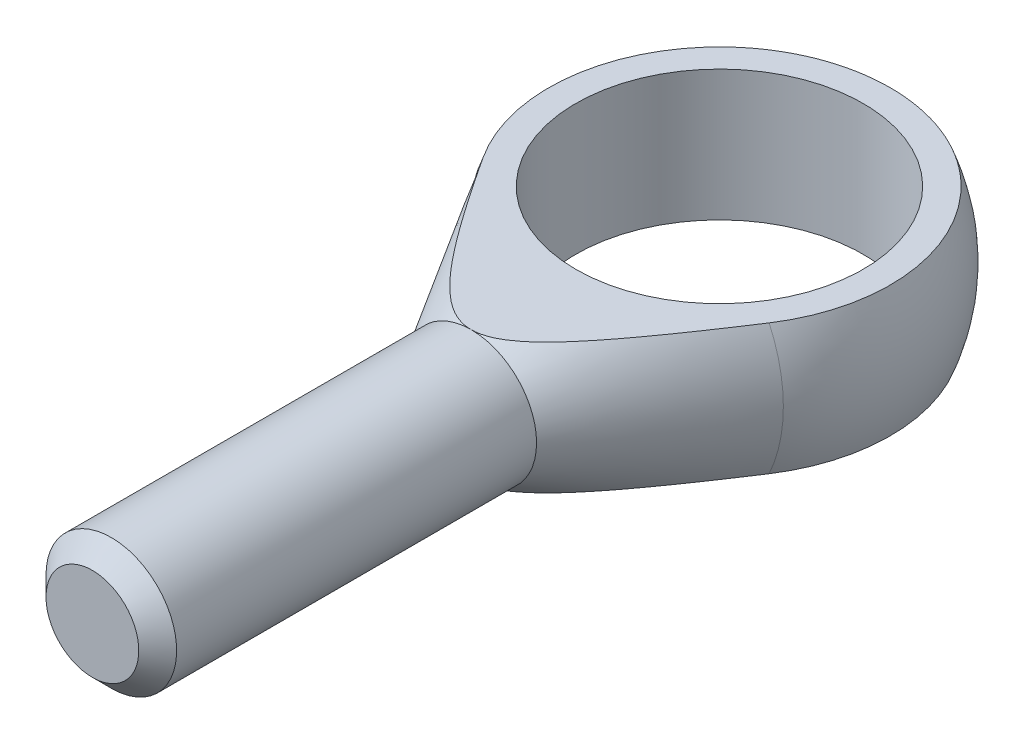
ISO-10303-21;
HEADER;
FILE_DESCRIPTION(('STEP AP214'),'2;1');
FILE_NAME('part.step','',(''),(''),'','','');
FILE_SCHEMA(('AUTOMOTIVE_DESIGN { 1 0 10303 214 1 1 1 1 }'));
ENDSEC;
DATA;
#1=APPLICATION_CONTEXT('core data for automotive mechanical design processes');
#2=APPLICATION_PROTOCOL_DEFINITION('international standard','automotive_design',2000,#1);
#3=PRODUCT_CONTEXT('',#1,'mechanical');
#4=PRODUCT('Part','Part','',(#3));
#5=PRODUCT_RELATED_PRODUCT_CATEGORY('part','',(#4));
#6=PRODUCT_DEFINITION_FORMATION('','',#4);
#7=PRODUCT_DEFINITION_CONTEXT('part definition',#1,'design');
#8=PRODUCT_DEFINITION('design','',#6,#7);
#9=PRODUCT_DEFINITION_SHAPE('','',#8);
#10=(LENGTH_UNIT() NAMED_UNIT(*) SI_UNIT(.MILLI.,.METRE.));
#11=(NAMED_UNIT(*) PLANE_ANGLE_UNIT() SI_UNIT($,.RADIAN.));
#12=(NAMED_UNIT(*) SI_UNIT($,.STERADIAN.) SOLID_ANGLE_UNIT());
#13=UNCERTAINTY_MEASURE_WITH_UNIT(LENGTH_MEASURE(1.E-05),#10,'distance_accuracy_value','');
#14=(GEOMETRIC_REPRESENTATION_CONTEXT(3) GLOBAL_UNCERTAINTY_ASSIGNED_CONTEXT((#13)) GLOBAL_UNIT_ASSIGNED_CONTEXT((#10,
#11,#12)) REPRESENTATION_CONTEXT('',''));
#15=CARTESIAN_POINT('',(0.,0.,0.));
#16=DIRECTION('',(0.,0.,1.));
#17=DIRECTION('',(1.,0.,0.));
#18=AXIS2_PLACEMENT_3D('',#15,#16,#17);
#19=CARTESIAN_POINT('',(0.,0.,19.));
#20=DIRECTION('',(0.,0.,-1.));
#21=DIRECTION('',(-1.,0.,0.));
#22=AXIS2_PLACEMENT_3D('',#19,#20,#21);
#23=CONICAL_SURFACE('',#22,5.,0.535846782161461);
#24=CARTESIAN_POINT('',(0.,0.,7.14797043355876));
#25=DIRECTION('',(0.,0.,-1.));
#26=DIRECTION('',(-1.,0.,0.));
#27=AXIS2_PLACEMENT_3D('',#24,#25,#26);
#28=CIRCLE('',#27,12.0377123524767);
#29=CARTESIAN_POINT('',(-10.9501834998766,-5.,7.14797043355876));
#30=VERTEX_POINT('',#29);
#31=CARTESIAN_POINT('',(-10.9501834998766,5.,7.14797043355876));
#32=VERTEX_POINT('',#31);
#33=EDGE_CURVE('E97',#30,#32,#28,.T.);
#34=ORIENTED_EDGE('',*,*,#33,.F.);
#35=CARTESIAN_POINT('',(-27.5216747950487,-5.,-19.6868467533451));
#36=CARTESIAN_POINT('',(-26.8051168821379,-5.,-18.4996029295613));
#37=CARTESIAN_POINT('',(-26.0879517963983,-5.,-17.312724591381));
#38=CARTESIAN_POINT('',(-24.6519124409138,-5.,-14.9399369655101));
#39=CARTESIAN_POINT('',(-23.933038103254,-5.,-13.7540277189286));
#40=CARTESIAN_POINT('',(-22.4907604144347,-5.,-11.3795894779701));
#41=CARTESIAN_POINT('',(-21.7673499482415,-5.,-10.1910648038436));
#42=CARTESIAN_POINT('',(-20.3176712993999,-5.,-7.81581921616296));
#43=CARTESIAN_POINT('',(-19.5914032247363,-5.,-6.62909823675509));
#44=CARTESIAN_POINT('',(-18.4180621747729,-5.,-4.71907587072312));
#45=CARTESIAN_POINT('',(-17.9722371174445,-5.,-3.99500799646675));
#46=CARTESIAN_POINT('',(-17.07873420989,-5.,-2.54801657698327));
#47=CARTESIAN_POINT('',(-16.6310563611422,-5.,-1.82509303084376));
#48=CARTESIAN_POINT('',(-15.7333105876282,-5.,-0.38060230674777));
#49=CARTESIAN_POINT('',(-15.2832423639096,-5.,0.340964685507134));
#50=CARTESIAN_POINT('',(-14.3801104781555,-5.,1.78221632636469));
#51=CARTESIAN_POINT('',(-13.9270468373551,-5.,2.5019009882612));
#52=CARTESIAN_POINT('',(-13.0183719308677,-5.,3.93655709385903));
#53=CARTESIAN_POINT('',(-12.5627728154824,-5.,4.65153622735253));
#54=CARTESIAN_POINT('',(-11.6462607381208,-5.,6.07812038044785));
#55=CARTESIAN_POINT('',(-11.1853476166804,-5.,6.78972529788625));
#56=CARTESIAN_POINT('',(-10.4884252851809,-5.,7.85337661529528));
#57=CARTESIAN_POINT('',(-10.2552199572124,-5.,8.20725993790403));
#58=CARTESIAN_POINT('',(-9.7865415844266,-5.,8.91352080836302));
#59=CARTESIAN_POINT('',(-9.55106855139165,-5.,9.26589836402305));
#60=CARTESIAN_POINT('',(-9.07736912487433,-5.,9.9687721944127));
#61=CARTESIAN_POINT('',(-8.83914287874569,-5.,10.3192685683675));
#62=CARTESIAN_POINT('',(-8.35926648097533,-5.,11.0179070106918));
#63=CARTESIAN_POINT('',(-8.11761638603106,-5.,11.3660491179062));
#64=CARTESIAN_POINT('',(-7.76694867030323,-5.,11.8645723805397));
#65=CARTESIAN_POINT('',(-7.65968068716014,-5.,12.0161848413487));
#66=CARTESIAN_POINT('',(-7.44421189836729,-5.,12.3187457785635));
#67=CARTESIAN_POINT('',(-7.33601109089996,-5.,12.4696942536747));
#68=CARTESIAN_POINT('',(-7.00982418698183,-5.,12.9214523394142));
#69=CARTESIAN_POINT('',(-6.79027807795586,-5.,13.2211397177003));
#70=CARTESIAN_POINT('',(-6.34464747347649,-5.,13.8182830927764));
#71=CARTESIAN_POINT('',(-6.11853290676104,-5.,14.1157167239452));
#72=CARTESIAN_POINT('',(-5.65943253203781,-5.,14.7050997150129));
#73=CARTESIAN_POINT('',(-5.42644893747396,-5.,14.9970507930015));
#74=CARTESIAN_POINT('',(-4.95936355734631,-5.,15.5635064957609));
#75=CARTESIAN_POINT('',(-4.72557415415001,-5.,15.8382660675872));
#76=CARTESIAN_POINT('',(-4.36588736454623,-5.,16.2427517565571));
#77=CARTESIAN_POINT('',(-4.24440071030617,-5.,16.3763980563313));
#78=CARTESIAN_POINT('',(-3.99791946384678,-5.,16.6404160321229));
#79=CARTESIAN_POINT('',(-3.87292505699722,-5.,16.7707878804937));
#80=CARTESIAN_POINT('',(-3.61986987093619,-5.,17.0263048409578));
#81=CARTESIAN_POINT('',(-3.49184512545001,-5.,17.1514854987268));
#82=CARTESIAN_POINT('',(-3.2308638083488,-5.,17.3966994554233));
#83=CARTESIAN_POINT('',(-3.09790598363392,-5.,17.5167314295556));
#84=CARTESIAN_POINT('',(-2.82648441555589,-5.,17.7497066715571));
#85=CARTESIAN_POINT('',(-2.68803582130148,-5.,17.8626674907372));
#86=CARTESIAN_POINT('',(-2.40425977681294,-5.,18.0795296565832));
#87=CARTESIAN_POINT('',(-2.25893753652119,-5.,18.183437700341));
#88=CARTESIAN_POINT('',(-2.05805903292423,-5.,18.3149377386343));
#89=CARTESIAN_POINT('',(-2.00603170012058,-5.,18.3479502151764));
#90=CARTESIAN_POINT('',(-1.9009678070416,-5.,18.4123398945579));
#91=CARTESIAN_POINT('',(-1.84793114130415,-5.,18.4437169252196));
#92=CARTESIAN_POINT('',(-1.68720117034428,-5.,18.5351485502978));
#93=CARTESIAN_POINT('',(-1.57792761187746,-5.,18.5924773552266));
#94=CARTESIAN_POINT('',(-1.35574780852512,-5.,18.6977832500928));
#95=CARTESIAN_POINT('',(-1.24286786301111,-5.,18.7458153810197));
#96=CARTESIAN_POINT('',(-1.01305691699007,-5.,18.8309730939753));
#97=CARTESIAN_POINT('',(-0.896128201896744,-5.,18.8681047203422));
#98=CARTESIAN_POINT('',(-0.693368431161798,-5.,18.9205773144876));
#99=CARTESIAN_POINT('',(-0.608360744872757,-5.,18.939114856993));
#100=CARTESIAN_POINT('',(-0.437102595613543,-5.,18.9691011459684));
#101=CARTESIAN_POINT('',(-0.350852365316355,-5.,18.9805512023969));
#102=CARTESIAN_POINT('',(-0.177555858678243,-5.,18.9959542278488));
#103=CARTESIAN_POINT('',(-0.0905086259155313,-5.,18.9998965285846));
#104=CARTESIAN_POINT('',(0.0835988581746955,-5.,19.0000994511255));
#105=CARTESIAN_POINT('',(0.17065910993531,-5.,18.9963596892118));
#106=CARTESIAN_POINT('',(0.343877048674531,-5.,18.981362334012));
#107=CARTESIAN_POINT('',(0.430036594461857,-5.,18.9701260794184));
#108=CARTESIAN_POINT('',(0.601146309785249,-5.,18.9405736667332));
#109=CARTESIAN_POINT('',(0.686095946423736,-5.,18.9222544832482));
#110=CARTESIAN_POINT('',(0.938364583999876,-5.,18.8575573708991));
#111=CARTESIAN_POINT('',(1.10323361877966,-5.,18.8014271298288));
#112=CARTESIAN_POINT('',(1.40111733433391,-5.,18.6785350830066));
#113=CARTESIAN_POINT('',(1.53529656308692,-5.,18.6144745643753));
#114=CARTESIAN_POINT('',(1.79759022421594,-5.,18.4748045112421));
#115=CARTESIAN_POINT('',(1.92569966464047,-5.,18.3991856796788));
#116=CARTESIAN_POINT('',(2.17671418883308,-5.,18.238763050346));
#117=CARTESIAN_POINT('',(2.29959516507467,-5.,18.1539220240954));
#118=CARTESIAN_POINT('',(2.54021774117244,-5.,17.9773855625617));
#119=CARTESIAN_POINT('',(2.65796130192946,-5.,17.8856927794258));
#120=CARTESIAN_POINT('',(2.87691021066059,-5.,17.7068333785212));
#121=CARTESIAN_POINT('',(2.97855492092567,-5.,17.6202006748159));
#122=CARTESIAN_POINT('',(3.17875378898104,-5.,17.4434254096633));
#123=CARTESIAN_POINT('',(3.27730757411228,-5.,17.353282427912));
#124=CARTESIAN_POINT('',(3.56903695575325,-5.,17.0784659285935));
#125=CARTESIAN_POINT('',(3.75816778755768,-5.,16.8894992445868));
#126=CARTESIAN_POINT('',(4.1285720680388,-5.,16.5032064063569));
#127=CARTESIAN_POINT('',(4.30982460814315,-5.,16.3058604645821));
#128=CARTESIAN_POINT('',(4.66576359900946,-5.,15.9054618539982));
#129=CARTESIAN_POINT('',(4.84045198681996,-5.,15.7024109001171));
#130=CARTESIAN_POINT('',(5.1856156524581,-5.,15.2908634388455));
#131=CARTESIAN_POINT('',(5.35606230180423,-5.,15.08234303335));
#132=CARTESIAN_POINT('',(5.69276378137943,-5.,14.6619324790733));
#133=CARTESIAN_POINT('',(5.85901834045012,-5.,14.4500421137502));
#134=CARTESIAN_POINT('',(6.18783211099718,-5.,14.0239593656337));
#135=CARTESIAN_POINT('',(6.35039680361062,-5.,13.8097712030379));
#136=CARTESIAN_POINT('',(6.67268359925878,-5.,13.3792817125091));
#137=CARTESIAN_POINT('',(6.83240579254539,-5.,13.1629804520078));
#138=CARTESIAN_POINT('',(7.30318009165603,-5.,12.5181428482633));
#139=CARTESIAN_POINT('',(7.6108372735722,-5.,12.0871285589375));
#140=CARTESIAN_POINT('',(8.21953566475007,-5.,11.2204448675236));
#141=CARTESIAN_POINT('',(8.52057653588419,-5.,10.7847752292061));
#142=CARTESIAN_POINT('',(9.11771369803161,-5.,9.90996491707371));
#143=CARTESIAN_POINT('',(9.41380920160351,-5.,9.47082370658258));
#144=CARTESIAN_POINT('',(10.0021526873591,-5.,8.58997041028337));
#145=CARTESIAN_POINT('',(10.294400634573,-5.,8.14825830116134));
#146=CARTESIAN_POINT('',(10.876159295446,-5.,7.26239036692929));
#147=CARTESIAN_POINT('',(11.1656669030936,-5.,6.81823250417363));
#148=CARTESIAN_POINT('',(11.7422377278992,-5.,5.9283318856805));
#149=CARTESIAN_POINT('',(12.029300934471,-5.,5.48258912309108));
#150=CARTESIAN_POINT('',(12.887469690666,-5.,4.14354910211432));
#151=CARTESIAN_POINT('',(13.4556114226021,-5.,3.24835281050474));
#152=CARTESIAN_POINT('',(14.5838378916705,-5.,1.45869412738122));
#153=CARTESIAN_POINT('',(15.1439477570793,-5.,0.564247537843128));
#154=CARTESIAN_POINT('',(16.2602717169444,-5.,-1.22710056504852));
#155=CARTESIAN_POINT('',(16.8164857212221,-5.,-2.12400213456426));
#156=CARTESIAN_POINT('',(17.9257700781496,-5.,-3.91923853169987));
#157=CARTESIAN_POINT('',(18.4788416243014,-5.,-4.81757262244384));
#158=CARTESIAN_POINT('',(19.5827487600806,-5.,-6.61561386364915));
#159=CARTESIAN_POINT('',(20.1335843481224,-5.,-7.51532101508349));
#160=CARTESIAN_POINT('',(21.2555774641654,-5.,-9.35193971398503));
#161=CARTESIAN_POINT('',(21.8266632389539,-5.,-10.2888950805096));
#162=CARTESIAN_POINT('',(22.9673906100151,-5.,-12.1638135369095));
#163=CARTESIAN_POINT('',(23.5370320551048,-5.,-13.1017767187421));
#164=CARTESIAN_POINT('',(24.676438313786,-5.,-14.9806287928047));
#165=CARTESIAN_POINT('',(25.2462003018514,-5.,-15.9215193981166));
#166=CARTESIAN_POINT('',(26.3846646499464,-5.,-17.8038096474694));
#167=CARTESIAN_POINT('',(26.9533671127067,-5.,-18.7452092293705));
#168=CARTESIAN_POINT('',(27.5216747950487,-5.,-19.6868467533451));
#169=B_SPLINE_CURVE_WITH_KNOTS('',3,(#35,#36,#37,#38,#39,#40,#41,#42,#43,#44,#45,#46,#47,#48,
#49,#50,#51,#52,#53,#54,#55,#56,#57,#58,#59,#60,#61,#62,#63,#64,#65,#66,#67,#68,#69,#70,#71,#72,
#73,#74,#75,#76,#77,#78,#79,#80,#81,#82,#83,#84,#85,#86,#87,#88,#89,#90,#91,#92,#93,#94,#95,#96,
#97,#98,#99,#100,#101,#102,#103,#104,#105,#106,#107,#108,#109,#110,#111,#112,#113,#114,#115,
#116,#117,#118,#119,#120,#121,#122,#123,#124,#125,#126,#127,#128,#129,#130,#131,#132,#133,#134,
#135,#136,#137,#138,#139,#140,#141,#142,#143,#144,#145,#146,#147,#148,#149,#150,#151,#152,#153,
#154,#155,#156,#157,#158,#159,#160,#161,#162,#163,#164,#165,#166,#167,#168),.UNSPECIFIED.,.F.,
.F.,(4,2,2,2,2,2,2,2,2,2,2,2,2,2,2,2,2,2,2,2,2,2,2,2,2,2,2,2,2,2,2,2,2,2,2,2,2,2,2,2,2,2,2,2,2,
2,2,2,2,2,2,2,2,2,2,2,2,2,2,2,2,2,2,2,2,2,4),(0.,4.16017275644715,8.32051367081187,
12.4946242600759,16.6685786023267,19.2195191466593,21.7704576560656,24.3217230861831,
26.8729704492061,29.4163572589162,31.9598205909249,33.2312553392193,34.5026834850894,
35.7740438955723,37.0453832774295,37.6025469742863,38.1597117569963,39.2741691645469,
40.3949611859593,41.5153959130323,42.5974046073537,43.1391887359739,43.6809442873302,
44.2179973762292,44.7551878340232,45.2909872386583,45.8263868411309,46.0112127120874,
46.1960580021365,46.565891265598,46.9334630430634,47.300830615031,47.5615817555544,
47.8222846878305,48.0833577952659,48.3444439436198,48.6047900657016,48.8652475147739,
49.385774106861,49.831220125778,50.2770263483844,50.7247042031201,51.1722096615079,
51.5727803004196,51.9733990501234,52.7750769858416,53.5787666778006,54.3822173120286,
55.1901094402998,55.9980536923669,56.8047067167549,57.6113340833314,59.1998927155699,
60.788532343453,62.3774225610992,63.9663272099705,65.5568572966443,67.1473942679763,
70.3281553662601,73.4941854578145,76.6602885937996,79.8250958604524,82.9899053708657,
86.2817448772344,89.5739157941029,92.873784017193,96.1733136365182),.UNSPECIFIED.);
#170=CARTESIAN_POINT('',(0.,-5.,19.));
#171=VERTEX_POINT('',#170);
#172=EDGE_CURVE('E93',#30,#171,#169,.T.);
#173=ORIENTED_EDGE('',*,*,#172,.T.);
#174=CARTESIAN_POINT('',(0.,0.,19.));
#175=DIRECTION('',(0.,0.,-1.));
#176=DIRECTION('',(-1.,0.,0.));
#177=AXIS2_PLACEMENT_3D('',#174,#175,#176);
#178=CIRCLE('',#177,5.);
#179=CARTESIAN_POINT('',(0.,5.,19.));
#180=VERTEX_POINT('',#179);
#181=EDGE_CURVE('E92',#171,#180,#178,.T.);
#182=ORIENTED_EDGE('',*,*,#181,.T.);
#183=CARTESIAN_POINT('',(27.5216747950487,5.,-19.6868467533451));
#184=CARTESIAN_POINT('',(26.8051168821379,5.,-18.4996029295613));
#185=CARTESIAN_POINT('',(26.0879517963983,5.,-17.312724591381));
#186=CARTESIAN_POINT('',(24.6519124409138,5.,-14.9399369655101));
#187=CARTESIAN_POINT('',(23.933038103254,5.,-13.7540277189286));
#188=CARTESIAN_POINT('',(22.4907604144347,5.,-11.3795894779701));
#189=CARTESIAN_POINT('',(21.7673499482415,5.,-10.1910648038436));
#190=CARTESIAN_POINT('',(20.3176712993999,5.,-7.81581921616296));
#191=CARTESIAN_POINT('',(19.5914032247363,5.,-6.62909823675509));
#192=CARTESIAN_POINT('',(18.4180621747729,5.,-4.71907587072312));
#193=CARTESIAN_POINT('',(17.9722371174445,5.,-3.99500799646675));
#194=CARTESIAN_POINT('',(17.07873420989,5.,-2.54801657698327));
#195=CARTESIAN_POINT('',(16.6310563611422,5.,-1.82509303084376));
#196=CARTESIAN_POINT('',(15.7333105876282,5.,-0.38060230674777));
#197=CARTESIAN_POINT('',(15.2832423639096,5.,0.340964685507134));
#198=CARTESIAN_POINT('',(14.3801104781555,5.,1.78221632636469));
#199=CARTESIAN_POINT('',(13.9270468373551,5.,2.5019009882612));
#200=CARTESIAN_POINT('',(13.0183719308677,5.,3.93655709385903));
#201=CARTESIAN_POINT('',(12.5627728154824,5.,4.65153622735253));
#202=CARTESIAN_POINT('',(11.6462607381208,5.,6.07812038044785));
#203=CARTESIAN_POINT('',(11.1853476166804,5.,6.78972529788625));
#204=CARTESIAN_POINT('',(10.4884252851809,5.,7.85337661529528));
#205=CARTESIAN_POINT('',(10.2552199572124,5.,8.20725993790403));
#206=CARTESIAN_POINT('',(9.7865415844266,5.,8.91352080836302));
#207=CARTESIAN_POINT('',(9.55106855139165,5.,9.26589836402305));
#208=CARTESIAN_POINT('',(9.07736912487433,5.,9.9687721944127));
#209=CARTESIAN_POINT('',(8.83914287874569,5.,10.3192685683675));
#210=CARTESIAN_POINT('',(8.35926648097533,5.,11.0179070106918));
#211=CARTESIAN_POINT('',(8.11761638603106,5.,11.3660491179062));
#212=CARTESIAN_POINT('',(7.76694867030323,5.,11.8645723805397));
#213=CARTESIAN_POINT('',(7.65968068716014,5.,12.0161848413487));
#214=CARTESIAN_POINT('',(7.44421189836729,5.,12.3187457785635));
#215=CARTESIAN_POINT('',(7.33601109089996,5.,12.4696942536747));
#216=CARTESIAN_POINT('',(7.00982418698183,5.,12.9214523394142));
#217=CARTESIAN_POINT('',(6.79027807795586,5.,13.2211397177003));
#218=CARTESIAN_POINT('',(6.34464747347649,5.,13.8182830927764));
#219=CARTESIAN_POINT('',(6.11853290676104,5.,14.1157167239452));
#220=CARTESIAN_POINT('',(5.65943253203781,5.,14.7050997150129));
#221=CARTESIAN_POINT('',(5.42644893747396,5.,14.9970507930015));
#222=CARTESIAN_POINT('',(4.95936355734631,5.,15.5635064957609));
#223=CARTESIAN_POINT('',(4.72557415415001,5.,15.8382660675872));
#224=CARTESIAN_POINT('',(4.36588736454623,5.,16.2427517565571));
#225=CARTESIAN_POINT('',(4.24440071030617,5.,16.3763980563313));
#226=CARTESIAN_POINT('',(3.99791946384678,5.,16.6404160321229));
#227=CARTESIAN_POINT('',(3.87292505699722,5.,16.7707878804937));
#228=CARTESIAN_POINT('',(3.61986987093619,5.,17.0263048409578));
#229=CARTESIAN_POINT('',(3.49184512545001,5.,17.1514854987268));
#230=CARTESIAN_POINT('',(3.2308638083488,5.,17.3966994554233));
#231=CARTESIAN_POINT('',(3.09790598363392,5.,17.5167314295556));
#232=CARTESIAN_POINT('',(2.82648441555589,5.,17.7497066715571));
#233=CARTESIAN_POINT('',(2.68803582130148,5.,17.8626674907372));
#234=CARTESIAN_POINT('',(2.40425977681294,5.,18.0795296565832));
#235=CARTESIAN_POINT('',(2.25893753652119,5.,18.183437700341));
#236=CARTESIAN_POINT('',(2.05805903292423,5.,18.3149377386343));
#237=CARTESIAN_POINT('',(2.00603170012058,5.,18.3479502151764));
#238=CARTESIAN_POINT('',(1.9009678070416,5.,18.4123398945579));
#239=CARTESIAN_POINT('',(1.84793114130415,5.,18.4437169252196));
#240=CARTESIAN_POINT('',(1.68720117034428,5.,18.5351485502978));
#241=CARTESIAN_POINT('',(1.57792761187746,5.,18.5924773552266));
#242=CARTESIAN_POINT('',(1.35574780852512,5.,18.6977832500928));
#243=CARTESIAN_POINT('',(1.24286786301111,5.,18.7458153810197));
#244=CARTESIAN_POINT('',(1.01305691699007,5.,18.8309730939753));
#245=CARTESIAN_POINT('',(0.896128201896744,5.,18.8681047203422));
#246=CARTESIAN_POINT('',(0.693368431161798,5.,18.9205773144876));
#247=CARTESIAN_POINT('',(0.608360744872757,5.,18.939114856993));
#248=CARTESIAN_POINT('',(0.437102595613543,5.,18.9691011459684));
#249=CARTESIAN_POINT('',(0.350852365316355,5.,18.9805512023969));
#250=CARTESIAN_POINT('',(0.177555858678243,5.,18.9959542278488));
#251=CARTESIAN_POINT('',(0.0905086259155313,5.,18.9998965285846));
#252=CARTESIAN_POINT('',(-0.0835988581746955,5.,19.0000994511255));
#253=CARTESIAN_POINT('',(-0.17065910993531,5.,18.9963596892118));
#254=CARTESIAN_POINT('',(-0.343877048674531,5.,18.981362334012));
#255=CARTESIAN_POINT('',(-0.430036594461857,5.,18.9701260794184));
#256=CARTESIAN_POINT('',(-0.601146309785249,5.,18.9405736667332));
#257=CARTESIAN_POINT('',(-0.686095946423736,5.,18.9222544832482));
#258=CARTESIAN_POINT('',(-0.938364583999876,5.,18.8575573708991));
#259=CARTESIAN_POINT('',(-1.10323361877966,5.,18.8014271298288));
#260=CARTESIAN_POINT('',(-1.40111733433391,5.,18.6785350830066));
#261=CARTESIAN_POINT('',(-1.53529656308692,5.,18.6144745643753));
#262=CARTESIAN_POINT('',(-1.79759022421594,5.,18.4748045112421));
#263=CARTESIAN_POINT('',(-1.92569966464047,5.,18.3991856796788));
#264=CARTESIAN_POINT('',(-2.17671418883308,5.,18.238763050346));
#265=CARTESIAN_POINT('',(-2.29959516507467,5.,18.1539220240954));
#266=CARTESIAN_POINT('',(-2.54021774117244,5.,17.9773855625617));
#267=CARTESIAN_POINT('',(-2.65796130192946,5.,17.8856927794258));
#268=CARTESIAN_POINT('',(-2.87691021066059,5.,17.7068333785212));
#269=CARTESIAN_POINT('',(-2.97855492092567,5.,17.6202006748159));
#270=CARTESIAN_POINT('',(-3.17875378898104,5.,17.4434254096633));
#271=CARTESIAN_POINT('',(-3.27730757411228,5.,17.353282427912));
#272=CARTESIAN_POINT('',(-3.56903695575325,5.,17.0784659285935));
#273=CARTESIAN_POINT('',(-3.75816778755768,5.,16.8894992445868));
#274=CARTESIAN_POINT('',(-4.1285720680388,5.,16.5032064063569));
#275=CARTESIAN_POINT('',(-4.30982460814315,5.,16.3058604645821));
#276=CARTESIAN_POINT('',(-4.66576359900946,5.,15.9054618539982));
#277=CARTESIAN_POINT('',(-4.84045198681996,5.,15.7024109001171));
#278=CARTESIAN_POINT('',(-5.1856156524581,5.,15.2908634388455));
#279=CARTESIAN_POINT('',(-5.35606230180423,5.,15.08234303335));
#280=CARTESIAN_POINT('',(-5.69276378137943,5.,14.6619324790733));
#281=CARTESIAN_POINT('',(-5.85901834045012,5.,14.4500421137502));
#282=CARTESIAN_POINT('',(-6.18783211099718,5.,14.0239593656337));
#283=CARTESIAN_POINT('',(-6.35039680361062,5.,13.8097712030379));
#284=CARTESIAN_POINT('',(-6.67268359925878,5.,13.3792817125091));
#285=CARTESIAN_POINT('',(-6.83240579254539,5.,13.1629804520078));
#286=CARTESIAN_POINT('',(-7.30318009165603,5.,12.5181428482633));
#287=CARTESIAN_POINT('',(-7.6108372735722,5.,12.0871285589375));
#288=CARTESIAN_POINT('',(-8.21953566475007,5.,11.2204448675236));
#289=CARTESIAN_POINT('',(-8.52057653588419,5.,10.7847752292061));
#290=CARTESIAN_POINT('',(-9.11771369803161,5.,9.90996491707371));
#291=CARTESIAN_POINT('',(-9.41380920160351,5.,9.47082370658258));
#292=CARTESIAN_POINT('',(-10.0021526873591,5.,8.58997041028337));
#293=CARTESIAN_POINT('',(-10.294400634573,5.,8.14825830116134));
#294=CARTESIAN_POINT('',(-10.876159295446,5.,7.26239036692929));
#295=CARTESIAN_POINT('',(-11.1656669030936,5.,6.81823250417363));
#296=CARTESIAN_POINT('',(-11.7422377278992,5.,5.9283318856805));
#297=CARTESIAN_POINT('',(-12.029300934471,5.,5.48258912309108));
#298=CARTESIAN_POINT('',(-12.887469690666,5.,4.14354910211432));
#299=CARTESIAN_POINT('',(-13.4556114226021,5.,3.24835281050474));
#300=CARTESIAN_POINT('',(-14.5838378916705,5.,1.45869412738122));
#301=CARTESIAN_POINT('',(-15.1439477570793,5.,0.564247537843128));
#302=CARTESIAN_POINT('',(-16.2602717169444,5.,-1.22710056504852));
#303=CARTESIAN_POINT('',(-16.8164857212221,5.,-2.12400213456426));
#304=CARTESIAN_POINT('',(-17.9257700781496,5.,-3.91923853169987));
#305=CARTESIAN_POINT('',(-18.4788416243014,5.,-4.81757262244384));
#306=CARTESIAN_POINT('',(-19.5827487600806,5.,-6.61561386364915));
#307=CARTESIAN_POINT('',(-20.1335843481224,5.,-7.51532101508349));
#308=CARTESIAN_POINT('',(-21.2555774641654,5.,-9.35193971398503));
#309=CARTESIAN_POINT('',(-21.8266632389539,5.,-10.2888950805096));
#310=CARTESIAN_POINT('',(-22.9673906100151,5.,-12.1638135369095));
#311=CARTESIAN_POINT('',(-23.5370320551048,5.,-13.1017767187421));
#312=CARTESIAN_POINT('',(-24.676438313786,5.,-14.9806287928047));
#313=CARTESIAN_POINT('',(-25.2462003018514,5.,-15.9215193981166));
#314=CARTESIAN_POINT('',(-26.3846646499464,5.,-17.8038096474694));
#315=CARTESIAN_POINT('',(-26.9533671127067,5.,-18.7452092293705));
#316=CARTESIAN_POINT('',(-27.5216747950487,5.,-19.6868467533451));
#317=B_SPLINE_CURVE_WITH_KNOTS('',3,(#183,#184,#185,#186,#187,#188,#189,#190,#191,#192,#193,
#194,#195,#196,#197,#198,#199,#200,#201,#202,#203,#204,#205,#206,#207,#208,#209,#210,#211,#212,
#213,#214,#215,#216,#217,#218,#219,#220,#221,#222,#223,#224,#225,#226,#227,#228,#229,#230,#231,
#232,#233,#234,#235,#236,#237,#238,#239,#240,#241,#242,#243,#244,#245,#246,#247,#248,#249,#250,
#251,#252,#253,#254,#255,#256,#257,#258,#259,#260,#261,#262,#263,#264,#265,#266,#267,#268,#269,
#270,#271,#272,#273,#274,#275,#276,#277,#278,#279,#280,#281,#282,#283,#284,#285,#286,#287,#288,
#289,#290,#291,#292,#293,#294,#295,#296,#297,#298,#299,#300,#301,#302,#303,#304,#305,#306,#307,
#308,#309,#310,#311,#312,#313,#314,#315,#316),.UNSPECIFIED.,.F.,.F.,(4,2,2,2,2,2,2,2,2,2,2,2,2,
2,2,2,2,2,2,2,2,2,2,2,2,2,2,2,2,2,2,2,2,2,2,2,2,2,2,2,2,2,2,2,2,2,2,2,2,2,2,2,2,2,2,2,2,2,2,2,2,
2,2,2,2,2,4),(0.,4.16017275644715,8.32051367081187,12.4946242600759,16.6685786023267,
19.2195191466593,21.7704576560656,24.3217230861831,26.8729704492061,29.4163572589162,
31.9598205909249,33.2312553392193,34.5026834850894,35.7740438955723,37.0453832774295,
37.6025469742863,38.1597117569963,39.2741691645469,40.3949611859593,41.5153959130323,
42.5974046073537,43.1391887359739,43.6809442873302,44.2179973762292,44.7551878340232,
45.2909872386583,45.8263868411309,46.0112127120874,46.1960580021365,46.565891265598,
46.9334630430634,47.300830615031,47.5615817555544,47.8222846878305,48.0833577952659,
48.3444439436198,48.6047900657016,48.8652475147739,49.385774106861,49.831220125778,
50.2770263483844,50.7247042031201,51.1722096615079,51.5727803004196,51.9733990501234,
52.7750769858416,53.5787666778006,54.3822173120286,55.1901094402998,55.9980536923669,
56.8047067167549,57.6113340833314,59.1998927155699,60.788532343453,62.3774225610992,
63.9663272099705,65.5568572966443,67.1473942679763,70.3281553662601,73.4941854578145,
76.6602885937996,79.8250958604524,82.9899053708657,86.2817448772344,89.5739157941029,
92.873784017193,96.1733136365182),.UNSPECIFIED.);
#318=EDGE_CURVE('E72',#180,#32,#317,.T.);
#319=ORIENTED_EDGE('',*,*,#318,.T.);
#320=EDGE_LOOP('',(#34,#173,#182,#319));
#321=FACE_BOUND('',#320,.T.);
#322=ADVANCED_FACE('F37',(#321),#23,.T.);
#323=EDGE_CURVE('E87',#180,#171,#178,.T.);
#324=ORIENTED_EDGE('',*,*,#323,.T.);
#325=CARTESIAN_POINT('',(10.9501834998766,-5.,7.14797043355876));
#326=VERTEX_POINT('',#325);
#327=EDGE_CURVE('E89',#171,#326,#169,.T.);
#328=ORIENTED_EDGE('',*,*,#327,.T.);
#329=CARTESIAN_POINT('',(10.9501834998766,5.,7.14797043355876));
#330=VERTEX_POINT('',#329);
#331=EDGE_CURVE('E88',#330,#326,#28,.T.);
#332=ORIENTED_EDGE('',*,*,#331,.F.);
#333=EDGE_CURVE('E75',#330,#180,#317,.T.);
#334=ORIENTED_EDGE('',*,*,#333,.T.);
#335=EDGE_LOOP('',(#324,#328,#332,#334));
#336=FACE_BOUND('',#335,.T.);
#337=ADVANCED_FACE('F85',(#336),#23,.T.);
#338=CARTESIAN_POINT('',(0.,0.,0.));
#339=DIRECTION('',(0.,0.,-1.));
#340=DIRECTION('',(1.,0.,0.));
#341=AXIS2_PLACEMENT_3D('',#338,#339,#340);
#342=SPHERICAL_SURFACE('',#341,14.);
#343=CARTESIAN_POINT('',(0.,-5.,0.));
#344=DIRECTION('',(0.,1.,0.));
#345=DIRECTION('',(0.,0.,1.));
#346=AXIS2_PLACEMENT_3D('',#343,#344,#345);
#347=CIRCLE('',#346,13.076696830622);
#348=EDGE_CURVE('E53',#326,#30,#347,.T.);
#349=ORIENTED_EDGE('',*,*,#348,.T.);
#350=ORIENTED_EDGE('',*,*,#33,.T.);
#351=CARTESIAN_POINT('',(0.,5.,0.));
#352=DIRECTION('',(0.,-1.,0.));
#353=DIRECTION('',(0.,0.,-1.));
#354=AXIS2_PLACEMENT_3D('',#351,#352,#353);
#355=CIRCLE('',#354,13.076696830622);
#356=EDGE_CURVE('E77',#32,#330,#355,.T.);
#357=ORIENTED_EDGE('',*,*,#356,.T.);
#358=ORIENTED_EDGE('',*,*,#331,.T.);
#359=EDGE_LOOP('',(#349,#350,#357,#358));
#360=FACE_BOUND('',#359,.T.);
#361=ADVANCED_FACE('F125',(#360),#342,.T.);
#362=CARTESIAN_POINT('',(0.,0.,48.));
#363=DIRECTION('',(0.,0.,-1.));
#364=DIRECTION('',(-1.,0.,0.));
#365=AXIS2_PLACEMENT_3D('',#362,#363,#364);
#366=PLANE('',#365);
#367=CARTESIAN_POINT('',(0.,0.,48.));
#368=DIRECTION('',(0.,0.,-1.));
#369=DIRECTION('',(-1.,0.,0.));
#370=AXIS2_PLACEMENT_3D('',#367,#368,#369);
#371=CIRCLE('',#370,3.54999999999999);
#372=CARTESIAN_POINT('',(-3.54999999999999,0.,48.));
#373=VERTEX_POINT('',#372);
#374=EDGE_CURVE('E11',#373,#373,#371,.F.);
#375=ORIENTED_EDGE('',*,*,#374,.T.);
#376=EDGE_LOOP('',(#375));
#377=FACE_BOUND('',#376,.T.);
#378=ADVANCED_FACE('F143',(#377),#366,.F.);
#379=CARTESIAN_POINT('',(0.,0.,-26.0435164980697));
#380=DIRECTION('',(0.,0.,-1.));
#381=DIRECTION('',(-1.,0.,0.));
#382=AXIS2_PLACEMENT_3D('',#379,#380,#381);
#383=CYLINDRICAL_SURFACE('',#382,5.);
#384=CARTESIAN_POINT('',(0.,0.,46.55));
#385=DIRECTION('',(0.,0.,-1.));
#386=DIRECTION('',(-1.,0.,0.));
#387=AXIS2_PLACEMENT_3D('',#384,#385,#386);
#388=CIRCLE('',#387,5.);
#389=CARTESIAN_POINT('',(-5.,0.,46.55));
#390=VERTEX_POINT('',#389);
#391=EDGE_CURVE('E46',#390,#390,#388,.T.);
#392=ORIENTED_EDGE('',*,*,#391,.T.);
#393=EDGE_LOOP('',(#392));
#394=FACE_BOUND('',#393,.T.);
#395=ORIENTED_EDGE('',*,*,#323,.F.);
#396=ORIENTED_EDGE('',*,*,#181,.F.);
#397=EDGE_LOOP('',(#395,#396));
#398=FACE_BOUND('',#397,.T.);
#399=ADVANCED_FACE('F96',(#394,#398),#383,.T.);
#400=CARTESIAN_POINT('',(-14.,5.,19.));
#401=DIRECTION('',(0.,-1.,0.));
#402=DIRECTION('',(0.,0.,-1.));
#403=AXIS2_PLACEMENT_3D('',#400,#401,#402);
#404=PLANE('',#403);
#405=CARTESIAN_POINT('',(0.,5.00000000000001,0.));
#406=DIRECTION('',(0.,1.,0.));
#407=DIRECTION('',(0.,0.,1.));
#408=AXIS2_PLACEMENT_3D('',#405,#406,#407);
#409=CIRCLE('',#408,11.);
#410=CARTESIAN_POINT('',(0.,5.00000000000001,11.));
#411=VERTEX_POINT('',#410);
#412=EDGE_CURVE('E201',#411,#411,#409,.T.);
#413=ORIENTED_EDGE('',*,*,#412,.F.);
#414=EDGE_LOOP('',(#413));
#415=FACE_BOUND('',#414,.T.);
#416=ORIENTED_EDGE('',*,*,#333,.F.);
#417=ORIENTED_EDGE('',*,*,#356,.F.);
#418=ORIENTED_EDGE('',*,*,#318,.F.);
#419=EDGE_LOOP('',(#416,#417,#418));
#420=FACE_BOUND('',#419,.T.);
#421=ADVANCED_FACE('F74',(#415,#420),#404,.F.);
#422=CARTESIAN_POINT('',(-14.,-5.,19.));
#423=DIRECTION('',(0.,1.,0.));
#424=DIRECTION('',(0.,0.,1.));
#425=AXIS2_PLACEMENT_3D('',#422,#423,#424);
#426=PLANE('',#425);
#427=CARTESIAN_POINT('',(0.,-5.00000000000001,0.));
#428=DIRECTION('',(0.,1.,0.));
#429=DIRECTION('',(0.,0.,1.));
#430=AXIS2_PLACEMENT_3D('',#427,#428,#429);
#431=CIRCLE('',#430,11.);
#432=CARTESIAN_POINT('',(0.,-5.00000000000001,11.));
#433=VERTEX_POINT('',#432);
#434=EDGE_CURVE('E81',#433,#433,#431,.T.);
#435=ORIENTED_EDGE('',*,*,#434,.T.);
#436=EDGE_LOOP('',(#435));
#437=FACE_BOUND('',#436,.T.);
#438=ORIENTED_EDGE('',*,*,#172,.F.);
#439=ORIENTED_EDGE('',*,*,#348,.F.);
#440=ORIENTED_EDGE('',*,*,#327,.F.);
#441=EDGE_LOOP('',(#438,#439,#440));
#442=FACE_BOUND('',#441,.T.);
#443=ADVANCED_FACE('F117',(#437,#442),#426,.F.);
#444=CARTESIAN_POINT('',(0.,-5.00000000000001,0.));
#445=DIRECTION('',(0.,1.,0.));
#446=DIRECTION('',(0.,0.,1.));
#447=AXIS2_PLACEMENT_3D('',#444,#445,#446);
#448=CYLINDRICAL_SURFACE('',#447,11.);
#449=ORIENTED_EDGE('',*,*,#434,.F.);
#450=EDGE_LOOP('',(#449));
#451=FACE_BOUND('',#450,.T.);
#452=ORIENTED_EDGE('',*,*,#412,.T.);
#453=EDGE_LOOP('',(#452));
#454=FACE_BOUND('',#453,.T.);
#455=ADVANCED_FACE('F112',(#451,#454),#448,.F.);
#456=CARTESIAN_POINT('',(0.,0.,46.55));
#457=DIRECTION('',(0.,0.,-1.));
#458=DIRECTION('',(-1.,0.,0.));
#459=AXIS2_PLACEMENT_3D('',#456,#457,#458);
#460=CONICAL_SURFACE('',#459,5.,0.785398163397455);
#461=ORIENTED_EDGE('',*,*,#374,.F.);
#462=EDGE_LOOP('',(#461));
#463=FACE_BOUND('',#462,.T.);
#464=ORIENTED_EDGE('',*,*,#391,.F.);
#465=EDGE_LOOP('',(#464));
#466=FACE_BOUND('',#465,.T.);
#467=ADVANCED_FACE('F40',(#463,#466),#460,.T.);
#468=CLOSED_SHELL('',(#322,#337,#361,#378,#399,#421,#443,#455,#467));
#469=MANIFOLD_SOLID_BREP('B2',#468);
#470=ADVANCED_BREP_SHAPE_REPRESENTATION('',(#18,#469),#14);
#471=SHAPE_DEFINITION_REPRESENTATION(#9,#470);
ENDSEC;
END-ISO-10303-21;
